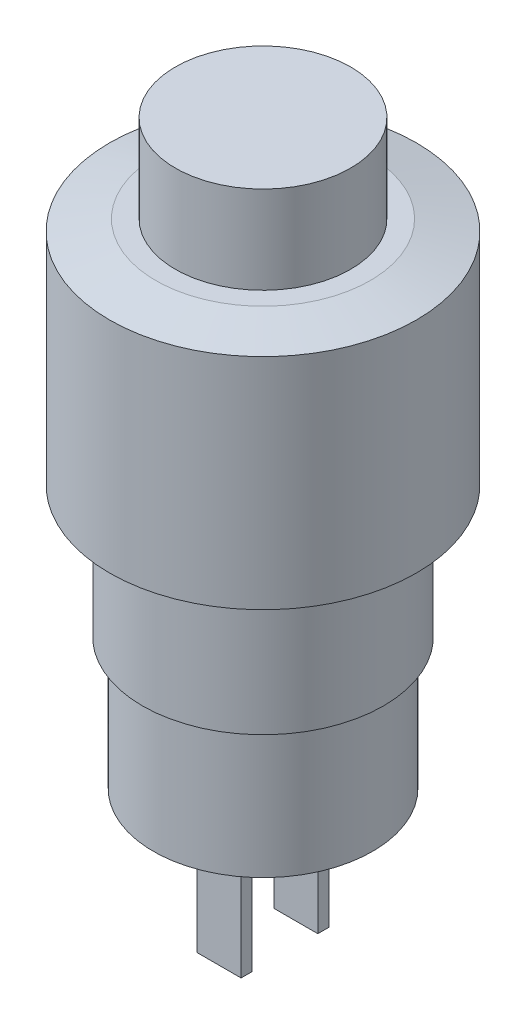
ISO-10303-21;
HEADER;
FILE_DESCRIPTION(('STEP AP214'),'2;1');
FILE_NAME('part.step','',(''),(''),'','','');
FILE_SCHEMA(('AUTOMOTIVE_DESIGN { 1 0 10303 214 1 1 1 1 }'));
ENDSEC;
DATA;
#1=APPLICATION_CONTEXT('core data for automotive mechanical design processes');
#2=APPLICATION_PROTOCOL_DEFINITION('international standard','automotive_design',2000,#1);
#3=PRODUCT_CONTEXT('',#1,'mechanical');
#4=PRODUCT('Part','Part','',(#3));
#5=PRODUCT_RELATED_PRODUCT_CATEGORY('part','',(#4));
#6=PRODUCT_DEFINITION_FORMATION('','',#4);
#7=PRODUCT_DEFINITION_CONTEXT('part definition',#1,'design');
#8=PRODUCT_DEFINITION('design','',#6,#7);
#9=PRODUCT_DEFINITION_SHAPE('','',#8);
#10=(LENGTH_UNIT() NAMED_UNIT(*) SI_UNIT(.MILLI.,.METRE.));
#11=(NAMED_UNIT(*) PLANE_ANGLE_UNIT() SI_UNIT($,.RADIAN.));
#12=(NAMED_UNIT(*) SI_UNIT($,.STERADIAN.) SOLID_ANGLE_UNIT());
#13=UNCERTAINTY_MEASURE_WITH_UNIT(LENGTH_MEASURE(1.E-05),#10,'distance_accuracy_value','');
#14=(GEOMETRIC_REPRESENTATION_CONTEXT(3) GLOBAL_UNCERTAINTY_ASSIGNED_CONTEXT((#13)) GLOBAL_UNIT_ASSIGNED_CONTEXT((#10,
#11,#12)) REPRESENTATION_CONTEXT('',''));
#15=CARTESIAN_POINT('',(0.,0.,0.));
#16=DIRECTION('',(0.,0.,1.));
#17=DIRECTION('',(1.,0.,0.));
#18=AXIS2_PLACEMENT_3D('',#15,#16,#17);
#19=CARTESIAN_POINT('',(5.,0.,0.));
#20=DIRECTION('',(0.,-1.,0.));
#21=DIRECTION('',(0.,0.,-1.));
#22=AXIS2_PLACEMENT_3D('',#19,#20,#21);
#23=PLANE('',#22);
#24=CARTESIAN_POINT('',(0.,0.,0.));
#25=DIRECTION('',(0.,-1.,0.));
#26=DIRECTION('',(0.,0.,-1.));
#27=AXIS2_PLACEMENT_3D('',#24,#25,#26);
#28=CIRCLE('',#27,5.);
#29=CARTESIAN_POINT('',(0.,0.,-5.));
#30=VERTEX_POINT('',#29);
#31=EDGE_CURVE('E180',#30,#30,#28,.T.);
#32=ORIENTED_EDGE('',*,*,#31,.T.);
#33=EDGE_LOOP('',(#32));
#34=FACE_BOUND('',#33,.T.);
#35=DIRECTION('',(-1.,0.,0.));
#36=VECTOR('',#35,1.);
#37=CARTESIAN_POINT('',(1.,0.,-1.5));
#38=LINE('',#37,#36);
#39=CARTESIAN_POINT('',(1.,0.,-1.5));
#40=VERTEX_POINT('',#39);
#41=CARTESIAN_POINT('',(-1.,0.,-1.5));
#42=VERTEX_POINT('',#41);
#43=EDGE_CURVE('E140',#40,#42,#38,.T.);
#44=ORIENTED_EDGE('',*,*,#43,.F.);
#45=DIRECTION('',(0.,0.,1.));
#46=VECTOR('',#45,1.);
#47=CARTESIAN_POINT('',(1.,0.,-1.5));
#48=LINE('',#47,#46);
#49=CARTESIAN_POINT('',(1.,0.,-2.));
#50=VERTEX_POINT('',#49);
#51=EDGE_CURVE('E134',#50,#40,#48,.T.);
#52=ORIENTED_EDGE('',*,*,#51,.F.);
#53=DIRECTION('',(1.,0.,0.));
#54=VECTOR('',#53,1.);
#55=CARTESIAN_POINT('',(1.,0.,-2.));
#56=LINE('',#55,#54);
#57=CARTESIAN_POINT('',(-1.,0.,-2.));
#58=VERTEX_POINT('',#57);
#59=EDGE_CURVE('E151',#58,#50,#56,.T.);
#60=ORIENTED_EDGE('',*,*,#59,.F.);
#61=DIRECTION('',(0.,0.,-1.));
#62=VECTOR('',#61,1.);
#63=CARTESIAN_POINT('',(-1.,0.,-1.5));
#64=LINE('',#63,#62);
#65=EDGE_CURVE('E163',#42,#58,#64,.T.);
#66=ORIENTED_EDGE('',*,*,#65,.F.);
#67=EDGE_LOOP('',(#44,#52,#60,#66));
#68=FACE_BOUND('',#67,.T.);
#69=DIRECTION('',(-1.,0.,0.));
#70=VECTOR('',#69,1.);
#71=CARTESIAN_POINT('',(1.,0.,2.));
#72=LINE('',#71,#70);
#73=CARTESIAN_POINT('',(1.,0.,2.));
#74=VERTEX_POINT('',#73);
#75=CARTESIAN_POINT('',(-1.,0.,2.));
#76=VERTEX_POINT('',#75);
#77=EDGE_CURVE('E447',#74,#76,#72,.T.);
#78=ORIENTED_EDGE('',*,*,#77,.F.);
#79=DIRECTION('',(0.,0.,1.));
#80=VECTOR('',#79,1.);
#81=CARTESIAN_POINT('',(1.,0.,1.5));
#82=LINE('',#81,#80);
#83=CARTESIAN_POINT('',(1.,0.,1.5));
#84=VERTEX_POINT('',#83);
#85=EDGE_CURVE('E131',#84,#74,#82,.T.);
#86=ORIENTED_EDGE('',*,*,#85,.F.);
#87=DIRECTION('',(1.,0.,0.));
#88=VECTOR('',#87,1.);
#89=CARTESIAN_POINT('',(1.,0.,1.5));
#90=LINE('',#89,#88);
#91=CARTESIAN_POINT('',(-1.,0.,1.5));
#92=VERTEX_POINT('',#91);
#93=EDGE_CURVE('E127',#92,#84,#90,.T.);
#94=ORIENTED_EDGE('',*,*,#93,.F.);
#95=DIRECTION('',(0.,0.,-1.));
#96=VECTOR('',#95,1.);
#97=CARTESIAN_POINT('',(-1.,0.,1.5));
#98=LINE('',#97,#96);
#99=EDGE_CURVE('E444',#76,#92,#98,.T.);
#100=ORIENTED_EDGE('',*,*,#99,.F.);
#101=EDGE_LOOP('',(#78,#86,#94,#100));
#102=FACE_BOUND('',#101,.T.);
#103=ADVANCED_FACE('F39',(#34,#68,#102),#23,.T.);
#104=CARTESIAN_POINT('',(0.,26.5,0.));
#105=DIRECTION('',(0.,1.,0.));
#106=DIRECTION('',(0.,0.,1.));
#107=AXIS2_PLACEMENT_3D('',#104,#105,#106);
#108=PLANE('',#107);
#109=CARTESIAN_POINT('',(0.,26.5,0.));
#110=DIRECTION('',(0.,-1.,0.));
#111=DIRECTION('',(0.,0.,-1.));
#112=AXIS2_PLACEMENT_3D('',#109,#110,#111);
#113=CIRCLE('',#112,4.);
#114=CARTESIAN_POINT('',(0.,26.5,-4.));
#115=VERTEX_POINT('',#114);
#116=EDGE_CURVE('E11',#115,#115,#113,.T.);
#117=ORIENTED_EDGE('',*,*,#116,.F.);
#118=EDGE_LOOP('',(#117));
#119=FACE_BOUND('',#118,.T.);
#120=ADVANCED_FACE('F41',(#119),#108,.T.);
#121=CARTESIAN_POINT('',(0.,0.,0.));
#122=DIRECTION('',(0.,-1.,0.));
#123=DIRECTION('',(0.,0.,-1.));
#124=AXIS2_PLACEMENT_3D('',#121,#122,#123);
#125=CYLINDRICAL_SURFACE('',#124,4.);
#126=ORIENTED_EDGE('',*,*,#116,.T.);
#127=EDGE_LOOP('',(#126));
#128=FACE_BOUND('',#127,.T.);
#129=CARTESIAN_POINT('',(0.,22.5,0.));
#130=DIRECTION('',(0.,-1.,0.));
#131=DIRECTION('',(0.,0.,-1.));
#132=AXIS2_PLACEMENT_3D('',#129,#130,#131);
#133=CIRCLE('',#132,4.);
#134=CARTESIAN_POINT('',(0.,22.5,-4.));
#135=VERTEX_POINT('',#134);
#136=EDGE_CURVE('E48',#135,#135,#133,.T.);
#137=ORIENTED_EDGE('',*,*,#136,.F.);
#138=EDGE_LOOP('',(#137));
#139=FACE_BOUND('',#138,.T.);
#140=ADVANCED_FACE('F215',(#128,#139),#125,.T.);
#141=CARTESIAN_POINT('',(4.,22.5,0.));
#142=DIRECTION('',(0.,1.,0.));
#143=DIRECTION('',(0.,0.,1.));
#144=AXIS2_PLACEMENT_3D('',#141,#142,#143);
#145=PLANE('',#144);
#146=ORIENTED_EDGE('',*,*,#136,.T.);
#147=EDGE_LOOP('',(#146));
#148=FACE_BOUND('',#147,.T.);
#149=CARTESIAN_POINT('',(0.,22.5,0.));
#150=DIRECTION('',(0.,-1.,0.));
#151=DIRECTION('',(0.,0.,-1.));
#152=AXIS2_PLACEMENT_3D('',#149,#150,#151);
#153=CIRCLE('',#152,4.89130434782605);
#154=CARTESIAN_POINT('',(0.,22.5,-4.89130434782605));
#155=VERTEX_POINT('',#154);
#156=EDGE_CURVE('E204',#155,#155,#153,.T.);
#157=ORIENTED_EDGE('',*,*,#156,.F.);
#158=EDGE_LOOP('',(#157));
#159=FACE_BOUND('',#158,.T.);
#160=ADVANCED_FACE('F212',(#148,#159),#145,.T.);
#161=CARTESIAN_POINT('',(0.,22.,0.));
#162=DIRECTION('',(0.,-1.,0.));
#163=DIRECTION('',(0.,0.,-1.));
#164=AXIS2_PLACEMENT_3D('',#161,#162,#163);
#165=CONICAL_SURFACE('',#164,7.,1.33798251368817);
#166=ORIENTED_EDGE('',*,*,#156,.T.);
#167=EDGE_LOOP('',(#166));
#168=FACE_BOUND('',#167,.T.);
#169=CARTESIAN_POINT('',(0.,22.,0.));
#170=DIRECTION('',(0.,-1.,0.));
#171=DIRECTION('',(0.,0.,-1.));
#172=AXIS2_PLACEMENT_3D('',#169,#170,#171);
#173=CIRCLE('',#172,7.);
#174=CARTESIAN_POINT('',(0.,22.,-7.));
#175=VERTEX_POINT('',#174);
#176=EDGE_CURVE('E200',#175,#175,#173,.T.);
#177=ORIENTED_EDGE('',*,*,#176,.F.);
#178=EDGE_LOOP('',(#177));
#179=FACE_BOUND('',#178,.T.);
#180=ADVANCED_FACE('F222',(#168,#179),#165,.T.);
#181=CARTESIAN_POINT('',(0.,0.,0.));
#182=DIRECTION('',(0.,-1.,0.));
#183=DIRECTION('',(0.,0.,-1.));
#184=AXIS2_PLACEMENT_3D('',#181,#182,#183);
#185=CYLINDRICAL_SURFACE('',#184,7.);
#186=ORIENTED_EDGE('',*,*,#176,.T.);
#187=EDGE_LOOP('',(#186));
#188=FACE_BOUND('',#187,.T.);
#189=CARTESIAN_POINT('',(0.,12.,0.));
#190=DIRECTION('',(0.,-1.,0.));
#191=DIRECTION('',(0.,0.,-1.));
#192=AXIS2_PLACEMENT_3D('',#189,#190,#191);
#193=CIRCLE('',#192,7.);
#194=CARTESIAN_POINT('',(0.,12.,-7.));
#195=VERTEX_POINT('',#194);
#196=EDGE_CURVE('E196',#195,#195,#193,.T.);
#197=ORIENTED_EDGE('',*,*,#196,.F.);
#198=EDGE_LOOP('',(#197));
#199=FACE_BOUND('',#198,.T.);
#200=ADVANCED_FACE('F250',(#188,#199),#185,.T.);
#201=CARTESIAN_POINT('',(7.,12.,0.));
#202=DIRECTION('',(0.,-1.,0.));
#203=DIRECTION('',(0.,0.,-1.));
#204=AXIS2_PLACEMENT_3D('',#201,#202,#203);
#205=PLANE('',#204);
#206=ORIENTED_EDGE('',*,*,#196,.T.);
#207=EDGE_LOOP('',(#206));
#208=FACE_BOUND('',#207,.T.);
#209=CARTESIAN_POINT('',(0.,12.,0.));
#210=DIRECTION('',(0.,-1.,0.));
#211=DIRECTION('',(0.,0.,-1.));
#212=AXIS2_PLACEMENT_3D('',#209,#210,#211);
#213=CIRCLE('',#212,5.5);
#214=CARTESIAN_POINT('',(0.,12.,-5.5));
#215=VERTEX_POINT('',#214);
#216=EDGE_CURVE('E192',#215,#215,#213,.T.);
#217=ORIENTED_EDGE('',*,*,#216,.F.);
#218=EDGE_LOOP('',(#217));
#219=FACE_BOUND('',#218,.T.);
#220=ADVANCED_FACE('F246',(#208,#219),#205,.T.);
#221=CARTESIAN_POINT('',(0.,0.,0.));
#222=DIRECTION('',(0.,-1.,0.));
#223=DIRECTION('',(0.,0.,-1.));
#224=AXIS2_PLACEMENT_3D('',#221,#222,#223);
#225=CYLINDRICAL_SURFACE('',#224,5.5);
#226=ORIENTED_EDGE('',*,*,#216,.T.);
#227=EDGE_LOOP('',(#226));
#228=FACE_BOUND('',#227,.T.);
#229=CARTESIAN_POINT('',(0.,6.,0.));
#230=DIRECTION('',(0.,-1.,0.));
#231=DIRECTION('',(0.,0.,-1.));
#232=AXIS2_PLACEMENT_3D('',#229,#230,#231);
#233=CIRCLE('',#232,5.5);
#234=CARTESIAN_POINT('',(0.,6.,-5.5));
#235=VERTEX_POINT('',#234);
#236=EDGE_CURVE('E188',#235,#235,#233,.T.);
#237=ORIENTED_EDGE('',*,*,#236,.F.);
#238=EDGE_LOOP('',(#237));
#239=FACE_BOUND('',#238,.T.);
#240=ADVANCED_FACE('F242',(#228,#239),#225,.T.);
#241=CARTESIAN_POINT('',(5.5,6.,0.));
#242=DIRECTION('',(0.,-1.,0.));
#243=DIRECTION('',(0.,0.,-1.));
#244=AXIS2_PLACEMENT_3D('',#241,#242,#243);
#245=PLANE('',#244);
#246=ORIENTED_EDGE('',*,*,#236,.T.);
#247=EDGE_LOOP('',(#246));
#248=FACE_BOUND('',#247,.T.);
#249=CARTESIAN_POINT('',(0.,6.,0.));
#250=DIRECTION('',(0.,-1.,0.));
#251=DIRECTION('',(0.,0.,-1.));
#252=AXIS2_PLACEMENT_3D('',#249,#250,#251);
#253=CIRCLE('',#252,5.);
#254=CARTESIAN_POINT('',(0.,6.,-5.));
#255=VERTEX_POINT('',#254);
#256=EDGE_CURVE('E184',#255,#255,#253,.T.);
#257=ORIENTED_EDGE('',*,*,#256,.F.);
#258=EDGE_LOOP('',(#257));
#259=FACE_BOUND('',#258,.T.);
#260=ADVANCED_FACE('F238',(#248,#259),#245,.T.);
#261=CARTESIAN_POINT('',(0.,0.,0.));
#262=DIRECTION('',(0.,-1.,0.));
#263=DIRECTION('',(0.,0.,-1.));
#264=AXIS2_PLACEMENT_3D('',#261,#262,#263);
#265=CYLINDRICAL_SURFACE('',#264,5.);
#266=ORIENTED_EDGE('',*,*,#256,.T.);
#267=EDGE_LOOP('',(#266));
#268=FACE_BOUND('',#267,.T.);
#269=ORIENTED_EDGE('',*,*,#31,.F.);
#270=EDGE_LOOP('',(#269));
#271=FACE_BOUND('',#270,.T.);
#272=ADVANCED_FACE('F235',(#268,#271),#265,.T.);
#273=CARTESIAN_POINT('',(1.,-6.,-1.5));
#274=DIRECTION('',(-1.,0.,0.));
#275=DIRECTION('',(0.,0.,1.));
#276=AXIS2_PLACEMENT_3D('',#273,#274,#275);
#277=PLANE('',#276);
#278=ORIENTED_EDGE('',*,*,#51,.T.);
#279=DIRECTION('',(0.,1.,0.));
#280=VECTOR('',#279,1.);
#281=CARTESIAN_POINT('',(1.,-6.,-1.5));
#282=LINE('',#281,#280);
#283=CARTESIAN_POINT('',(1.,-6.,-1.5));
#284=VERTEX_POINT('',#283);
#285=EDGE_CURVE('E177',#284,#40,#282,.T.);
#286=ORIENTED_EDGE('',*,*,#285,.F.);
#287=DIRECTION('',(0.,0.,1.));
#288=VECTOR('',#287,1.);
#289=CARTESIAN_POINT('',(1.,-6.,-1.5));
#290=LINE('',#289,#288);
#291=CARTESIAN_POINT('',(1.,-6.,-2.));
#292=VERTEX_POINT('',#291);
#293=EDGE_CURVE('E146',#292,#284,#290,.T.);
#294=ORIENTED_EDGE('',*,*,#293,.F.);
#295=DIRECTION('',(0.,1.,0.));
#296=VECTOR('',#295,1.);
#297=CARTESIAN_POINT('',(1.,-6.,-2.));
#298=LINE('',#297,#296);
#299=EDGE_CURVE('E159',#292,#50,#298,.T.);
#300=ORIENTED_EDGE('',*,*,#299,.T.);
#301=EDGE_LOOP('',(#278,#286,#294,#300));
#302=FACE_BOUND('',#301,.T.);
#303=ADVANCED_FACE('F233',(#302),#277,.F.);
#304=CARTESIAN_POINT('',(1.,-6.,-1.5));
#305=DIRECTION('',(0.,0.,-1.));
#306=DIRECTION('',(-1.,0.,0.));
#307=AXIS2_PLACEMENT_3D('',#304,#305,#306);
#308=PLANE('',#307);
#309=ORIENTED_EDGE('',*,*,#43,.T.);
#310=DIRECTION('',(0.,1.,0.));
#311=VECTOR('',#310,1.);
#312=CARTESIAN_POINT('',(-1.,-6.,-1.5));
#313=LINE('',#312,#311);
#314=CARTESIAN_POINT('',(-1.,-6.,-1.5));
#315=VERTEX_POINT('',#314);
#316=EDGE_CURVE('E173',#315,#42,#313,.T.);
#317=ORIENTED_EDGE('',*,*,#316,.F.);
#318=DIRECTION('',(-1.,0.,0.));
#319=VECTOR('',#318,1.);
#320=CARTESIAN_POINT('',(1.,-6.,-1.5));
#321=LINE('',#320,#319);
#322=EDGE_CURVE('E150',#284,#315,#321,.T.);
#323=ORIENTED_EDGE('',*,*,#322,.F.);
#324=ORIENTED_EDGE('',*,*,#285,.T.);
#325=EDGE_LOOP('',(#309,#317,#323,#324));
#326=FACE_BOUND('',#325,.T.);
#327=ADVANCED_FACE('F294',(#326),#308,.F.);
#328=CARTESIAN_POINT('',(-1.,-6.,-1.5));
#329=DIRECTION('',(1.,0.,0.));
#330=DIRECTION('',(0.,0.,-1.));
#331=AXIS2_PLACEMENT_3D('',#328,#329,#330);
#332=PLANE('',#331);
#333=ORIENTED_EDGE('',*,*,#65,.T.);
#334=DIRECTION('',(0.,1.,0.));
#335=VECTOR('',#334,1.);
#336=CARTESIAN_POINT('',(-1.,-6.,-2.));
#337=LINE('',#336,#335);
#338=CARTESIAN_POINT('',(-1.,-6.,-2.));
#339=VERTEX_POINT('',#338);
#340=EDGE_CURVE('E63',#339,#58,#337,.T.);
#341=ORIENTED_EDGE('',*,*,#340,.F.);
#342=DIRECTION('',(0.,0.,-1.));
#343=VECTOR('',#342,1.);
#344=CARTESIAN_POINT('',(-1.,-6.,-1.5));
#345=LINE('',#344,#343);
#346=EDGE_CURVE('E154',#315,#339,#345,.T.);
#347=ORIENTED_EDGE('',*,*,#346,.F.);
#348=ORIENTED_EDGE('',*,*,#316,.T.);
#349=EDGE_LOOP('',(#333,#341,#347,#348));
#350=FACE_BOUND('',#349,.T.);
#351=ADVANCED_FACE('F300',(#350),#332,.F.);
#352=CARTESIAN_POINT('',(1.,-6.,-2.));
#353=DIRECTION('',(0.,0.,1.));
#354=DIRECTION('',(1.,0.,0.));
#355=AXIS2_PLACEMENT_3D('',#352,#353,#354);
#356=PLANE('',#355);
#357=ORIENTED_EDGE('',*,*,#59,.T.);
#358=ORIENTED_EDGE('',*,*,#299,.F.);
#359=DIRECTION('',(1.,0.,0.));
#360=VECTOR('',#359,1.);
#361=CARTESIAN_POINT('',(1.,-6.,-2.));
#362=LINE('',#361,#360);
#363=EDGE_CURVE('E157',#339,#292,#362,.T.);
#364=ORIENTED_EDGE('',*,*,#363,.F.);
#365=ORIENTED_EDGE('',*,*,#340,.T.);
#366=EDGE_LOOP('',(#357,#358,#364,#365));
#367=FACE_BOUND('',#366,.T.);
#368=ADVANCED_FACE('F306',(#367),#356,.F.);
#369=CARTESIAN_POINT('',(0.,-6.,0.));
#370=DIRECTION('',(0.,1.,0.));
#371=DIRECTION('',(0.,0.,1.));
#372=AXIS2_PLACEMENT_3D('',#369,#370,#371);
#373=PLANE('',#372);
#374=ORIENTED_EDGE('',*,*,#293,.T.);
#375=ORIENTED_EDGE('',*,*,#322,.T.);
#376=ORIENTED_EDGE('',*,*,#346,.T.);
#377=ORIENTED_EDGE('',*,*,#363,.T.);
#378=EDGE_LOOP('',(#374,#375,#376,#377));
#379=FACE_BOUND('',#378,.T.);
#380=ADVANCED_FACE('F313',(#379),#373,.F.);
#381=CARTESIAN_POINT('',(1.,-6.,1.5));
#382=DIRECTION('',(-1.,0.,0.));
#383=DIRECTION('',(0.,0.,1.));
#384=AXIS2_PLACEMENT_3D('',#381,#382,#383);
#385=PLANE('',#384);
#386=ORIENTED_EDGE('',*,*,#85,.T.);
#387=DIRECTION('',(0.,1.,0.));
#388=VECTOR('',#387,1.);
#389=CARTESIAN_POINT('',(1.,-6.,2.));
#390=LINE('',#389,#388);
#391=CARTESIAN_POINT('',(1.,-6.,2.));
#392=VERTEX_POINT('',#391);
#393=EDGE_CURVE('E110',#392,#74,#390,.T.);
#394=ORIENTED_EDGE('',*,*,#393,.F.);
#395=DIRECTION('',(0.,0.,1.));
#396=VECTOR('',#395,1.);
#397=CARTESIAN_POINT('',(1.,-6.,1.5));
#398=LINE('',#397,#396);
#399=CARTESIAN_POINT('',(1.,-6.,1.5));
#400=VERTEX_POINT('',#399);
#401=EDGE_CURVE('E118',#400,#392,#398,.T.);
#402=ORIENTED_EDGE('',*,*,#401,.F.);
#403=DIRECTION('',(0.,1.,0.));
#404=VECTOR('',#403,1.);
#405=CARTESIAN_POINT('',(1.,-6.,1.5));
#406=LINE('',#405,#404);
#407=EDGE_CURVE('E440',#400,#84,#406,.T.);
#408=ORIENTED_EDGE('',*,*,#407,.T.);
#409=EDGE_LOOP('',(#386,#394,#402,#408));
#410=FACE_BOUND('',#409,.T.);
#411=ADVANCED_FACE('F129',(#410),#385,.F.);
#412=CARTESIAN_POINT('',(1.,-6.,2.));
#413=DIRECTION('',(0.,0.,-1.));
#414=DIRECTION('',(-1.,0.,0.));
#415=AXIS2_PLACEMENT_3D('',#412,#413,#414);
#416=PLANE('',#415);
#417=ORIENTED_EDGE('',*,*,#77,.T.);
#418=DIRECTION('',(0.,1.,0.));
#419=VECTOR('',#418,1.);
#420=CARTESIAN_POINT('',(-1.,-6.,2.));
#421=LINE('',#420,#419);
#422=CARTESIAN_POINT('',(-1.,-6.,2.));
#423=VERTEX_POINT('',#422);
#424=EDGE_CURVE('E113',#423,#76,#421,.T.);
#425=ORIENTED_EDGE('',*,*,#424,.F.);
#426=DIRECTION('',(-1.,0.,0.));
#427=VECTOR('',#426,1.);
#428=CARTESIAN_POINT('',(1.,-6.,2.));
#429=LINE('',#428,#427);
#430=EDGE_CURVE('E106',#392,#423,#429,.T.);
#431=ORIENTED_EDGE('',*,*,#430,.F.);
#432=ORIENTED_EDGE('',*,*,#393,.T.);
#433=EDGE_LOOP('',(#417,#425,#431,#432));
#434=FACE_BOUND('',#433,.T.);
#435=ADVANCED_FACE('F108',(#434),#416,.F.);
#436=CARTESIAN_POINT('',(-1.,-6.,1.5));
#437=DIRECTION('',(1.,0.,0.));
#438=DIRECTION('',(0.,0.,-1.));
#439=AXIS2_PLACEMENT_3D('',#436,#437,#438);
#440=PLANE('',#439);
#441=ORIENTED_EDGE('',*,*,#99,.T.);
#442=DIRECTION('',(0.,1.,0.));
#443=VECTOR('',#442,1.);
#444=CARTESIAN_POINT('',(-1.,-6.,1.5));
#445=LINE('',#444,#443);
#446=CARTESIAN_POINT('',(-1.,-6.,1.5));
#447=VERTEX_POINT('',#446);
#448=EDGE_CURVE('E55',#447,#92,#445,.T.);
#449=ORIENTED_EDGE('',*,*,#448,.F.);
#450=DIRECTION('',(0.,0.,-1.));
#451=VECTOR('',#450,1.);
#452=CARTESIAN_POINT('',(-1.,-6.,1.5));
#453=LINE('',#452,#451);
#454=EDGE_CURVE('E117',#423,#447,#453,.T.);
#455=ORIENTED_EDGE('',*,*,#454,.F.);
#456=ORIENTED_EDGE('',*,*,#424,.T.);
#457=EDGE_LOOP('',(#441,#449,#455,#456));
#458=FACE_BOUND('',#457,.T.);
#459=ADVANCED_FACE('F330',(#458),#440,.F.);
#460=CARTESIAN_POINT('',(1.,-6.,1.5));
#461=DIRECTION('',(0.,0.,1.));
#462=DIRECTION('',(1.,0.,0.));
#463=AXIS2_PLACEMENT_3D('',#460,#461,#462);
#464=PLANE('',#463);
#465=ORIENTED_EDGE('',*,*,#93,.T.);
#466=ORIENTED_EDGE('',*,*,#407,.F.);
#467=DIRECTION('',(1.,0.,0.));
#468=VECTOR('',#467,1.);
#469=CARTESIAN_POINT('',(1.,-6.,1.5));
#470=LINE('',#469,#468);
#471=EDGE_CURVE('E122',#447,#400,#470,.T.);
#472=ORIENTED_EDGE('',*,*,#471,.F.);
#473=ORIENTED_EDGE('',*,*,#448,.T.);
#474=EDGE_LOOP('',(#465,#466,#472,#473));
#475=FACE_BOUND('',#474,.T.);
#476=ADVANCED_FACE('F336',(#475),#464,.F.);
#477=CARTESIAN_POINT('',(0.,-6.,0.));
#478=DIRECTION('',(0.,-1.,0.));
#479=DIRECTION('',(0.,0.,-1.));
#480=AXIS2_PLACEMENT_3D('',#477,#478,#479);
#481=PLANE('',#480);
#482=ORIENTED_EDGE('',*,*,#401,.T.);
#483=ORIENTED_EDGE('',*,*,#430,.T.);
#484=ORIENTED_EDGE('',*,*,#454,.T.);
#485=ORIENTED_EDGE('',*,*,#471,.T.);
#486=EDGE_LOOP('',(#482,#483,#484,#485));
#487=FACE_BOUND('',#486,.T.);
#488=ADVANCED_FACE('F121',(#487),#481,.T.);
#489=CLOSED_SHELL('',(#103,#120,#140,#160,#180,#200,#220,#240,#260,#272,#303,#327,#351,#368,
#380,#411,#435,#459,#476,#488));
#490=MANIFOLD_SOLID_BREP('B2',#489);
#491=ADVANCED_BREP_SHAPE_REPRESENTATION('',(#18,#490),#14);
#492=SHAPE_DEFINITION_REPRESENTATION(#9,#491);
ENDSEC;
END-ISO-10303-21;
